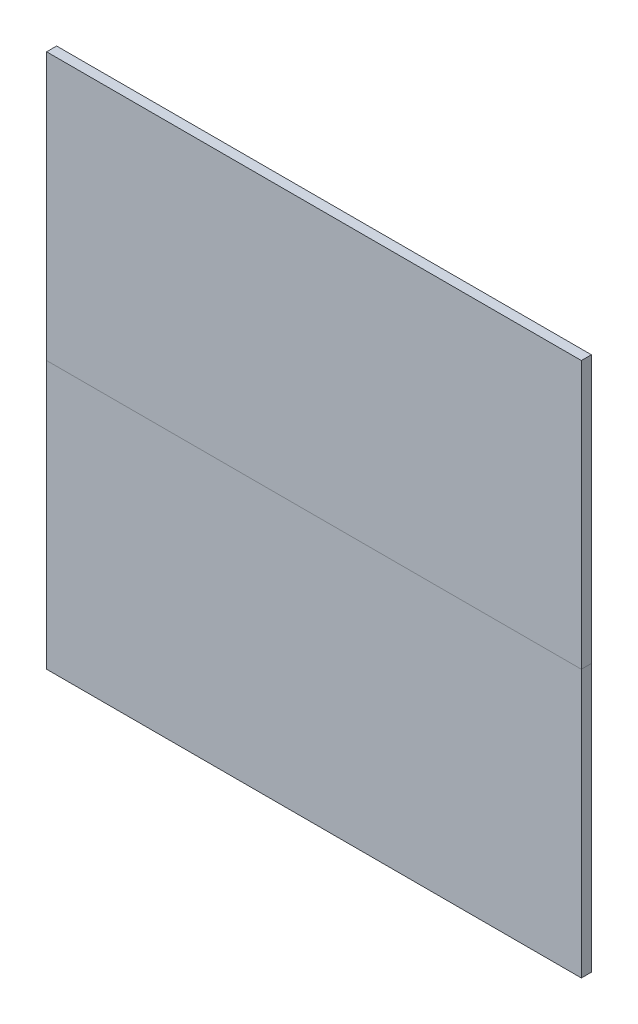
ISO-10303-21;
HEADER;
FILE_DESCRIPTION(('STEP AP214'),'2;1');
FILE_NAME('part.step','',(''),(''),'','','');
FILE_SCHEMA(('AUTOMOTIVE_DESIGN { 1 0 10303 214 1 1 1 1 }'));
ENDSEC;
DATA;
#1=APPLICATION_CONTEXT('core data for automotive mechanical design processes');
#2=APPLICATION_PROTOCOL_DEFINITION('international standard','automotive_design',2000,#1);
#3=PRODUCT_CONTEXT('',#1,'mechanical');
#4=PRODUCT('Part','Part','',(#3));
#5=PRODUCT_RELATED_PRODUCT_CATEGORY('part','',(#4));
#6=PRODUCT_DEFINITION_FORMATION('','',#4);
#7=PRODUCT_DEFINITION_CONTEXT('part definition',#1,'design');
#8=PRODUCT_DEFINITION('design','',#6,#7);
#9=PRODUCT_DEFINITION_SHAPE('','',#8);
#10=(LENGTH_UNIT() NAMED_UNIT(*) SI_UNIT(.MILLI.,.METRE.));
#11=(NAMED_UNIT(*) PLANE_ANGLE_UNIT() SI_UNIT($,.RADIAN.));
#12=(NAMED_UNIT(*) SI_UNIT($,.STERADIAN.) SOLID_ANGLE_UNIT());
#13=UNCERTAINTY_MEASURE_WITH_UNIT(LENGTH_MEASURE(1.E-05),#10,'distance_accuracy_value','');
#14=(GEOMETRIC_REPRESENTATION_CONTEXT(3) GLOBAL_UNCERTAINTY_ASSIGNED_CONTEXT((#13)) GLOBAL_UNIT_ASSIGNED_CONTEXT((#10,
#11,#12)) REPRESENTATION_CONTEXT('',''));
#15=CARTESIAN_POINT('',(0.,0.,0.));
#16=DIRECTION('',(0.,0.,1.));
#17=DIRECTION('',(1.,0.,0.));
#18=AXIS2_PLACEMENT_3D('',#15,#16,#17);
#19=CARTESIAN_POINT('',(0.,0.,0.));
#20=DIRECTION('',(0.,0.,-1.));
#21=DIRECTION('',(-1.,0.,0.));
#22=AXIS2_PLACEMENT_3D('',#19,#20,#21);
#23=PLANE('',#22);
#24=DIRECTION('',(0.,-1.,0.));
#25=VECTOR('',#24,1.);
#26=CARTESIAN_POINT('',(0.,8.,0.));
#27=LINE('',#26,#25);
#28=CARTESIAN_POINT('',(0.,16.,0.));
#29=VERTEX_POINT('',#28);
#30=CARTESIAN_POINT('',(0.,8.,0.));
#31=VERTEX_POINT('',#30);
#32=EDGE_CURVE('E56',#29,#31,#27,.T.);
#33=ORIENTED_EDGE('',*,*,#32,.F.);
#34=DIRECTION('',(-1.,0.,0.));
#35=VECTOR('',#34,1.);
#36=CARTESIAN_POINT('',(0.,16.,0.));
#37=LINE('',#36,#35);
#38=CARTESIAN_POINT('',(16.,16.,0.));
#39=VERTEX_POINT('',#38);
#40=EDGE_CURVE('E79',#39,#29,#37,.T.);
#41=ORIENTED_EDGE('',*,*,#40,.F.);
#42=DIRECTION('',(0.,1.,0.));
#43=VECTOR('',#42,1.);
#44=CARTESIAN_POINT('',(16.,8.,0.));
#45=LINE('',#44,#43);
#46=CARTESIAN_POINT('',(16.,8.,0.));
#47=VERTEX_POINT('',#46);
#48=EDGE_CURVE('E84',#47,#39,#45,.T.);
#49=ORIENTED_EDGE('',*,*,#48,.F.);
#50=DIRECTION('',(1.,0.,0.));
#51=VECTOR('',#50,1.);
#52=CARTESIAN_POINT('',(0.,8.,0.));
#53=LINE('',#52,#51);
#54=EDGE_CURVE('E99',#31,#47,#53,.T.);
#55=ORIENTED_EDGE('',*,*,#54,.F.);
#56=EDGE_LOOP('',(#33,#41,#49,#55));
#57=FACE_BOUND('',#56,.T.);
#58=ADVANCED_FACE('F48',(#57),#23,.T.);
#59=CARTESIAN_POINT('',(0.,0.,0.3));
#60=DIRECTION('',(0.,0.,-1.));
#61=DIRECTION('',(-1.,0.,0.));
#62=AXIS2_PLACEMENT_3D('',#59,#60,#61);
#63=PLANE('',#62);
#64=DIRECTION('',(0.,-1.,0.));
#65=VECTOR('',#64,1.);
#66=CARTESIAN_POINT('',(0.,8.,0.3));
#67=LINE('',#66,#65);
#68=CARTESIAN_POINT('',(0.,16.,0.3));
#69=VERTEX_POINT('',#68);
#70=CARTESIAN_POINT('',(0.,8.,0.3));
#71=VERTEX_POINT('',#70);
#72=EDGE_CURVE('E108',#69,#71,#67,.T.);
#73=ORIENTED_EDGE('',*,*,#72,.T.);
#74=DIRECTION('',(1.,0.,0.));
#75=VECTOR('',#74,1.);
#76=CARTESIAN_POINT('',(0.,8.,0.3));
#77=LINE('',#76,#75);
#78=CARTESIAN_POINT('',(16.,8.,0.3));
#79=VERTEX_POINT('',#78);
#80=EDGE_CURVE('E97',#71,#79,#77,.T.);
#81=ORIENTED_EDGE('',*,*,#80,.T.);
#82=DIRECTION('',(0.,1.,0.));
#83=VECTOR('',#82,1.);
#84=CARTESIAN_POINT('',(16.,8.,0.3));
#85=LINE('',#84,#83);
#86=CARTESIAN_POINT('',(16.,16.,0.3));
#87=VERTEX_POINT('',#86);
#88=EDGE_CURVE('E100',#79,#87,#85,.T.);
#89=ORIENTED_EDGE('',*,*,#88,.T.);
#90=DIRECTION('',(-1.,0.,0.));
#91=VECTOR('',#90,1.);
#92=CARTESIAN_POINT('',(0.,16.,0.3));
#93=LINE('',#92,#91);
#94=EDGE_CURVE('E105',#87,#69,#93,.T.);
#95=ORIENTED_EDGE('',*,*,#94,.T.);
#96=EDGE_LOOP('',(#73,#81,#89,#95));
#97=FACE_BOUND('',#96,.T.);
#98=ADVANCED_FACE('F107',(#97),#63,.F.);
#99=CARTESIAN_POINT('',(0.,8.,-17.8885438199983));
#100=DIRECTION('',(0.,-1.,0.));
#101=DIRECTION('',(0.,0.,-1.));
#102=AXIS2_PLACEMENT_3D('',#99,#100,#101);
#103=PLANE('',#102);
#104=DIRECTION('',(0.,0.,1.));
#105=VECTOR('',#104,1.);
#106=CARTESIAN_POINT('',(0.,8.,-17.8885438199983));
#107=LINE('',#106,#105);
#108=EDGE_CURVE('E12',#31,#71,#107,.T.);
#109=ORIENTED_EDGE('',*,*,#108,.F.);
#110=ORIENTED_EDGE('',*,*,#54,.T.);
#111=DIRECTION('',(0.,0.,1.));
#112=VECTOR('',#111,1.);
#113=CARTESIAN_POINT('',(16.,8.,-17.8885438199983));
#114=LINE('',#113,#112);
#115=EDGE_CURVE('E94',#47,#79,#114,.T.);
#116=ORIENTED_EDGE('',*,*,#115,.T.);
#117=ORIENTED_EDGE('',*,*,#80,.F.);
#118=EDGE_LOOP('',(#109,#110,#116,#117));
#119=FACE_BOUND('',#118,.T.);
#120=ADVANCED_FACE('F95',(#119),#103,.T.);
#121=CARTESIAN_POINT('',(16.,8.,-17.8885438199983));
#122=DIRECTION('',(1.,0.,0.));
#123=DIRECTION('',(0.,0.,-1.));
#124=AXIS2_PLACEMENT_3D('',#121,#122,#123);
#125=PLANE('',#124);
#126=ORIENTED_EDGE('',*,*,#115,.F.);
#127=ORIENTED_EDGE('',*,*,#48,.T.);
#128=DIRECTION('',(0.,0.,1.));
#129=VECTOR('',#128,1.);
#130=CARTESIAN_POINT('',(16.,16.,-17.8885438199983));
#131=LINE('',#130,#129);
#132=EDGE_CURVE('E89',#39,#87,#131,.T.);
#133=ORIENTED_EDGE('',*,*,#132,.T.);
#134=ORIENTED_EDGE('',*,*,#88,.F.);
#135=EDGE_LOOP('',(#126,#127,#133,#134));
#136=FACE_BOUND('',#135,.T.);
#137=ADVANCED_FACE('F101',(#136),#125,.T.);
#138=CARTESIAN_POINT('',(0.,16.,-17.8885438199983));
#139=DIRECTION('',(0.,1.,0.));
#140=DIRECTION('',(0.,0.,1.));
#141=AXIS2_PLACEMENT_3D('',#138,#139,#140);
#142=PLANE('',#141);
#143=ORIENTED_EDGE('',*,*,#132,.F.);
#144=ORIENTED_EDGE('',*,*,#40,.T.);
#145=DIRECTION('',(0.,0.,1.));
#146=VECTOR('',#145,1.);
#147=CARTESIAN_POINT('',(0.,16.,-17.8885438199983));
#148=LINE('',#147,#146);
#149=EDGE_CURVE('E117',#29,#69,#148,.T.);
#150=ORIENTED_EDGE('',*,*,#149,.T.);
#151=ORIENTED_EDGE('',*,*,#94,.F.);
#152=EDGE_LOOP('',(#143,#144,#150,#151));
#153=FACE_BOUND('',#152,.T.);
#154=ADVANCED_FACE('F123',(#153),#142,.T.);
#155=CARTESIAN_POINT('',(0.,8.,-17.8885438199983));
#156=DIRECTION('',(-1.,0.,0.));
#157=DIRECTION('',(0.,0.,1.));
#158=AXIS2_PLACEMENT_3D('',#155,#156,#157);
#159=PLANE('',#158);
#160=ORIENTED_EDGE('',*,*,#149,.F.);
#161=ORIENTED_EDGE('',*,*,#32,.T.);
#162=ORIENTED_EDGE('',*,*,#108,.T.);
#163=ORIENTED_EDGE('',*,*,#72,.F.);
#164=EDGE_LOOP('',(#160,#161,#162,#163));
#165=FACE_BOUND('',#164,.T.);
#166=ADVANCED_FACE('F124',(#165),#159,.T.);
#167=CLOSED_SHELL('',(#58,#98,#120,#137,#154,#166));
#168=MANIFOLD_SOLID_BREP('B2',#167);
#169=CARTESIAN_POINT('',(0.,0.,0.3));
#170=DIRECTION('',(1.,0.,0.));
#171=DIRECTION('',(0.,0.,-1.));
#172=AXIS2_PLACEMENT_3D('',#169,#170,#171);
#173=PLANE('',#172);
#174=DIRECTION('',(0.,-1.,0.));
#175=VECTOR('',#174,1.);
#176=CARTESIAN_POINT('',(0.,0.,0.));
#177=LINE('',#176,#175);
#178=CARTESIAN_POINT('',(0.,8.,0.));
#179=VERTEX_POINT('',#178);
#180=CARTESIAN_POINT('',(0.,0.,0.));
#181=VERTEX_POINT('',#180);
#182=EDGE_CURVE('E238',#179,#181,#177,.T.);
#183=ORIENTED_EDGE('',*,*,#182,.T.);
#184=DIRECTION('',(0.,0.,-1.));
#185=VECTOR('',#184,1.);
#186=CARTESIAN_POINT('',(0.,0.,0.3));
#187=LINE('',#186,#185);
#188=CARTESIAN_POINT('',(0.,0.,0.3));
#189=VERTEX_POINT('',#188);
#190=EDGE_CURVE('E46',#189,#181,#187,.T.);
#191=ORIENTED_EDGE('',*,*,#190,.F.);
#192=DIRECTION('',(0.,-1.,0.));
#193=VECTOR('',#192,1.);
#194=CARTESIAN_POINT('',(0.,0.,0.3));
#195=LINE('',#194,#193);
#196=CARTESIAN_POINT('',(0.,8.,0.3));
#197=VERTEX_POINT('',#196);
#198=EDGE_CURVE('E224',#197,#189,#195,.T.);
#199=ORIENTED_EDGE('',*,*,#198,.F.);
#200=DIRECTION('',(0.,0.,-1.));
#201=VECTOR('',#200,1.);
#202=CARTESIAN_POINT('',(0.,8.,0.3));
#203=LINE('',#202,#201);
#204=EDGE_CURVE('E234',#197,#179,#203,.T.);
#205=ORIENTED_EDGE('',*,*,#204,.T.);
#206=EDGE_LOOP('',(#183,#191,#199,#205));
#207=FACE_BOUND('',#206,.T.);
#208=ADVANCED_FACE('F173',(#207),#173,.F.);
#209=CARTESIAN_POINT('',(0.,0.,0.3));
#210=DIRECTION('',(0.,1.,0.));
#211=DIRECTION('',(0.,0.,1.));
#212=AXIS2_PLACEMENT_3D('',#209,#210,#211);
#213=PLANE('',#212);
#214=DIRECTION('',(1.,0.,0.));
#215=VECTOR('',#214,1.);
#216=CARTESIAN_POINT('',(0.,0.,0.));
#217=LINE('',#216,#215);
#218=CARTESIAN_POINT('',(16.,0.,0.));
#219=VERTEX_POINT('',#218);
#220=EDGE_CURVE('E229',#181,#219,#217,.T.);
#221=ORIENTED_EDGE('',*,*,#220,.T.);
#222=DIRECTION('',(0.,0.,-1.));
#223=VECTOR('',#222,1.);
#224=CARTESIAN_POINT('',(16.,0.,0.3));
#225=LINE('',#224,#223);
#226=CARTESIAN_POINT('',(16.,0.,0.3));
#227=VERTEX_POINT('',#226);
#228=EDGE_CURVE('E181',#227,#219,#225,.T.);
#229=ORIENTED_EDGE('',*,*,#228,.F.);
#230=DIRECTION('',(1.,0.,0.));
#231=VECTOR('',#230,1.);
#232=CARTESIAN_POINT('',(0.,0.,0.3));
#233=LINE('',#232,#231);
#234=EDGE_CURVE('E219',#189,#227,#233,.T.);
#235=ORIENTED_EDGE('',*,*,#234,.F.);
#236=ORIENTED_EDGE('',*,*,#190,.T.);
#237=EDGE_LOOP('',(#221,#229,#235,#236));
#238=FACE_BOUND('',#237,.T.);
#239=ADVANCED_FACE('F228',(#238),#213,.F.);
#240=CARTESIAN_POINT('',(16.,0.,0.3));
#241=DIRECTION('',(-1.,0.,0.));
#242=DIRECTION('',(0.,0.,1.));
#243=AXIS2_PLACEMENT_3D('',#240,#241,#242);
#244=PLANE('',#243);
#245=DIRECTION('',(0.,1.,0.));
#246=VECTOR('',#245,1.);
#247=CARTESIAN_POINT('',(16.,0.,0.));
#248=LINE('',#247,#246);
#249=CARTESIAN_POINT('',(16.,8.,0.));
#250=VERTEX_POINT('',#249);
#251=EDGE_CURVE('E206',#219,#250,#248,.T.);
#252=ORIENTED_EDGE('',*,*,#251,.T.);
#253=DIRECTION('',(0.,0.,-1.));
#254=VECTOR('',#253,1.);
#255=CARTESIAN_POINT('',(16.,8.,0.3));
#256=LINE('',#255,#254);
#257=CARTESIAN_POINT('',(16.,8.,0.3));
#258=VERTEX_POINT('',#257);
#259=EDGE_CURVE('E230',#258,#250,#256,.T.);
#260=ORIENTED_EDGE('',*,*,#259,.F.);
#261=DIRECTION('',(0.,1.,0.));
#262=VECTOR('',#261,1.);
#263=CARTESIAN_POINT('',(16.,0.,0.3));
#264=LINE('',#263,#262);
#265=EDGE_CURVE('E222',#227,#258,#264,.T.);
#266=ORIENTED_EDGE('',*,*,#265,.F.);
#267=ORIENTED_EDGE('',*,*,#228,.T.);
#268=EDGE_LOOP('',(#252,#260,#266,#267));
#269=FACE_BOUND('',#268,.T.);
#270=ADVANCED_FACE('F231',(#269),#244,.F.);
#271=CARTESIAN_POINT('',(0.,8.,0.3));
#272=DIRECTION('',(0.,-1.,0.));
#273=DIRECTION('',(0.,0.,-1.));
#274=AXIS2_PLACEMENT_3D('',#271,#272,#273);
#275=PLANE('',#274);
#276=DIRECTION('',(-1.,0.,0.));
#277=VECTOR('',#276,1.);
#278=CARTESIAN_POINT('',(0.,8.,0.));
#279=LINE('',#278,#277);
#280=EDGE_CURVE('E212',#250,#179,#279,.T.);
#281=ORIENTED_EDGE('',*,*,#280,.T.);
#282=ORIENTED_EDGE('',*,*,#204,.F.);
#283=DIRECTION('',(-1.,0.,0.));
#284=VECTOR('',#283,1.);
#285=CARTESIAN_POINT('',(0.,8.,0.3));
#286=LINE('',#285,#284);
#287=EDGE_CURVE('E189',#258,#197,#286,.T.);
#288=ORIENTED_EDGE('',*,*,#287,.F.);
#289=ORIENTED_EDGE('',*,*,#259,.T.);
#290=EDGE_LOOP('',(#281,#282,#288,#289));
#291=FACE_BOUND('',#290,.T.);
#292=ADVANCED_FACE('F247',(#291),#275,.F.);
#293=CARTESIAN_POINT('',(0.,0.,0.3));
#294=DIRECTION('',(0.,0.,-1.));
#295=DIRECTION('',(-1.,0.,0.));
#296=AXIS2_PLACEMENT_3D('',#293,#294,#295);
#297=PLANE('',#296);
#298=ORIENTED_EDGE('',*,*,#198,.T.);
#299=ORIENTED_EDGE('',*,*,#234,.T.);
#300=ORIENTED_EDGE('',*,*,#265,.T.);
#301=ORIENTED_EDGE('',*,*,#287,.T.);
#302=EDGE_LOOP('',(#298,#299,#300,#301));
#303=FACE_BOUND('',#302,.T.);
#304=ADVANCED_FACE('F220',(#303),#297,.F.);
#305=CARTESIAN_POINT('',(0.,0.,0.));
#306=DIRECTION('',(0.,0.,-1.));
#307=DIRECTION('',(-1.,0.,0.));
#308=AXIS2_PLACEMENT_3D('',#305,#306,#307);
#309=PLANE('',#308);
#310=ORIENTED_EDGE('',*,*,#182,.F.);
#311=ORIENTED_EDGE('',*,*,#280,.F.);
#312=ORIENTED_EDGE('',*,*,#251,.F.);
#313=ORIENTED_EDGE('',*,*,#220,.F.);
#314=EDGE_LOOP('',(#310,#311,#312,#313));
#315=FACE_BOUND('',#314,.T.);
#316=ADVANCED_FACE('F250',(#315),#309,.T.);
#317=CLOSED_SHELL('',(#208,#239,#270,#292,#304,#316));
#318=MANIFOLD_SOLID_BREP('B6',#317);
#319=ADVANCED_BREP_SHAPE_REPRESENTATION('',(#18,#168,#318),#14);
#320=SHAPE_DEFINITION_REPRESENTATION(#9,#319);
ENDSEC;
END-ISO-10303-21;
